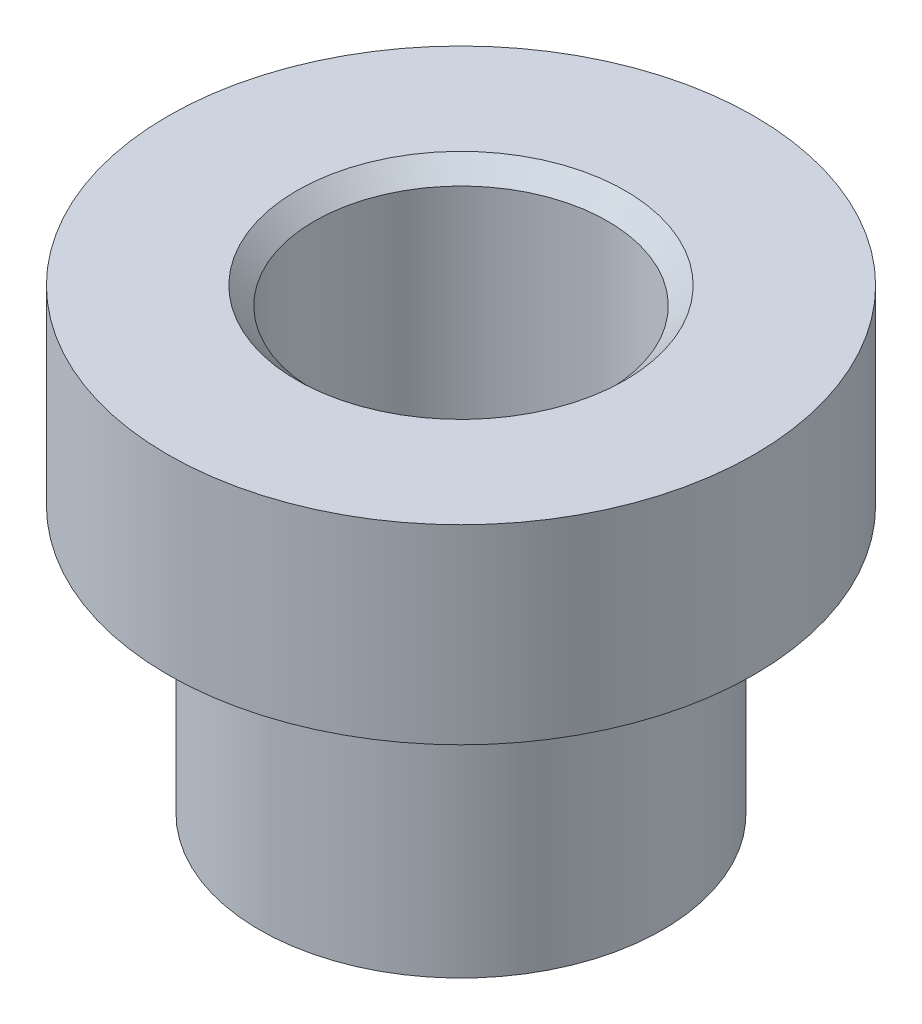
ISO-10303-21;
HEADER;
FILE_DESCRIPTION(('STEP AP214'),'2;1');
FILE_NAME('part.step','',(''),(''),'','','');
FILE_SCHEMA(('AUTOMOTIVE_DESIGN { 1 0 10303 214 1 1 1 1 }'));
ENDSEC;
DATA;
#1=APPLICATION_CONTEXT('core data for automotive mechanical design processes');
#2=APPLICATION_PROTOCOL_DEFINITION('international standard','automotive_design',2000,#1);
#3=PRODUCT_CONTEXT('',#1,'mechanical');
#4=PRODUCT('Part','Part','',(#3));
#5=PRODUCT_RELATED_PRODUCT_CATEGORY('part','',(#4));
#6=PRODUCT_DEFINITION_FORMATION('','',#4);
#7=PRODUCT_DEFINITION_CONTEXT('part definition',#1,'design');
#8=PRODUCT_DEFINITION('design','',#6,#7);
#9=PRODUCT_DEFINITION_SHAPE('','',#8);
#10=(LENGTH_UNIT() NAMED_UNIT(*) SI_UNIT(.MILLI.,.METRE.));
#11=(NAMED_UNIT(*) PLANE_ANGLE_UNIT() SI_UNIT($,.RADIAN.));
#12=(NAMED_UNIT(*) SI_UNIT($,.STERADIAN.) SOLID_ANGLE_UNIT());
#13=UNCERTAINTY_MEASURE_WITH_UNIT(LENGTH_MEASURE(1.E-05),#10,'distance_accuracy_value','');
#14=(GEOMETRIC_REPRESENTATION_CONTEXT(3) GLOBAL_UNCERTAINTY_ASSIGNED_CONTEXT((#13)) GLOBAL_UNIT_ASSIGNED_CONTEXT((#10,
#11,#12)) REPRESENTATION_CONTEXT('',''));
#15=CARTESIAN_POINT('',(0.,0.,0.));
#16=DIRECTION('',(0.,0.,1.));
#17=DIRECTION('',(1.,0.,0.));
#18=AXIS2_PLACEMENT_3D('',#15,#16,#17);
#19=CARTESIAN_POINT('',(0.,-11.049,0.));
#20=DIRECTION('',(0.,1.,0.));
#21=DIRECTION('',(-1.,0.,0.));
#22=AXIS2_PLACEMENT_3D('',#19,#20,#21);
#23=CYLINDRICAL_SURFACE('',#22,8.73125);
#24=CARTESIAN_POINT('',(0.,0.,0.));
#25=DIRECTION('',(0.,1.,0.));
#26=DIRECTION('',(-1.,0.,0.));
#27=AXIS2_PLACEMENT_3D('',#24,#25,#26);
#28=CIRCLE('',#27,8.73125);
#29=CARTESIAN_POINT('',(-8.73125,0.,0.));
#30=VERTEX_POINT('',#29);
#31=EDGE_CURVE('E57',#30,#30,#28,.T.);
#32=ORIENTED_EDGE('',*,*,#31,.F.);
#33=EDGE_LOOP('',(#32));
#34=FACE_BOUND('',#33,.T.);
#35=CARTESIAN_POINT('',(0.,-11.557,0.));
#36=DIRECTION('',(0.,1.,0.));
#37=DIRECTION('',(-1.,0.,0.));
#38=AXIS2_PLACEMENT_3D('',#35,#36,#37);
#39=CIRCLE('',#38,8.73125);
#40=CARTESIAN_POINT('',(-8.73125,-11.557,0.));
#41=VERTEX_POINT('',#40);
#42=EDGE_CURVE('E42',#41,#41,#39,.T.);
#43=ORIENTED_EDGE('',*,*,#42,.T.);
#44=EDGE_LOOP('',(#43));
#45=FACE_BOUND('',#44,.T.);
#46=ADVANCED_FACE('F31',(#34,#45),#23,.T.);
#47=CARTESIAN_POINT('',(0.,-11.557,0.));
#48=DIRECTION('',(0.,1.,0.));
#49=DIRECTION('',(-1.,0.,0.));
#50=AXIS2_PLACEMENT_3D('',#47,#48,#49);
#51=PLANE('',#50);
#52=ORIENTED_EDGE('',*,*,#42,.F.);
#53=EDGE_LOOP('',(#52));
#54=FACE_BOUND('',#53,.T.);
#55=ADVANCED_FACE('F65',(#54),#51,.F.);
#56=CARTESIAN_POINT('',(6.35,-11.049,0.));
#57=DIRECTION('',(0.,-1.,0.));
#58=DIRECTION('',(1.,0.,0.));
#59=AXIS2_PLACEMENT_3D('',#56,#57,#58);
#60=PLANE('',#59);
#61=CARTESIAN_POINT('',(0.,-11.049,0.));
#62=DIRECTION('',(0.,1.,0.));
#63=DIRECTION('',(-1.,0.,0.));
#64=AXIS2_PLACEMENT_3D('',#61,#62,#63);
#65=CIRCLE('',#64,6.35);
#66=CARTESIAN_POINT('',(-6.35,-11.049,0.));
#67=VERTEX_POINT('',#66);
#68=EDGE_CURVE('E46',#67,#67,#65,.T.);
#69=ORIENTED_EDGE('',*,*,#68,.T.);
#70=EDGE_LOOP('',(#69));
#71=FACE_BOUND('',#70,.T.);
#72=ADVANCED_FACE('F69',(#71),#60,.F.);
#73=CARTESIAN_POINT('',(0.,-11.049,0.));
#74=DIRECTION('',(0.,1.,0.));
#75=DIRECTION('',(-1.,0.,0.));
#76=AXIS2_PLACEMENT_3D('',#73,#74,#75);
#77=CYLINDRICAL_SURFACE('',#76,6.35);
#78=CARTESIAN_POINT('',(0.,7.493,0.));
#79=DIRECTION('',(0.,-1.,0.));
#80=DIRECTION('',(1.,0.,0.));
#81=AXIS2_PLACEMENT_3D('',#78,#79,#80);
#82=CIRCLE('',#81,6.35);
#83=CARTESIAN_POINT('',(6.35,7.493,0.));
#84=VERTEX_POINT('',#83);
#85=EDGE_CURVE('E38',#84,#84,#82,.F.);
#86=ORIENTED_EDGE('',*,*,#85,.T.);
#87=EDGE_LOOP('',(#86));
#88=FACE_BOUND('',#87,.T.);
#89=ORIENTED_EDGE('',*,*,#68,.F.);
#90=EDGE_LOOP('',(#89));
#91=FACE_BOUND('',#90,.T.);
#92=ADVANCED_FACE('F74',(#88,#91),#77,.F.);
#93=CARTESIAN_POINT('',(12.7,8.255,0.));
#94=DIRECTION('',(0.,-1.,0.));
#95=DIRECTION('',(1.,0.,0.));
#96=AXIS2_PLACEMENT_3D('',#93,#94,#95);
#97=PLANE('',#96);
#98=CARTESIAN_POINT('',(0.,8.255,0.));
#99=DIRECTION('',(0.,-1.,0.));
#100=DIRECTION('',(1.,0.,0.));
#101=AXIS2_PLACEMENT_3D('',#98,#99,#100);
#102=CIRCLE('',#101,7.11200000000001);
#103=CARTESIAN_POINT('',(7.11200000000001,8.255,0.));
#104=VERTEX_POINT('',#103);
#105=EDGE_CURVE('E10',#104,#104,#102,.T.);
#106=ORIENTED_EDGE('',*,*,#105,.T.);
#107=EDGE_LOOP('',(#106));
#108=FACE_BOUND('',#107,.T.);
#109=CARTESIAN_POINT('',(0.,8.255,0.));
#110=DIRECTION('',(0.,1.,0.));
#111=DIRECTION('',(-1.,0.,0.));
#112=AXIS2_PLACEMENT_3D('',#109,#110,#111);
#113=CIRCLE('',#112,12.7);
#114=CARTESIAN_POINT('',(-12.7,8.255,0.));
#115=VERTEX_POINT('',#114);
#116=EDGE_CURVE('E51',#115,#115,#113,.T.);
#117=ORIENTED_EDGE('',*,*,#116,.T.);
#118=EDGE_LOOP('',(#117));
#119=FACE_BOUND('',#118,.T.);
#120=ADVANCED_FACE('F80',(#108,#119),#97,.F.);
#121=CARTESIAN_POINT('',(0.,-11.049,0.));
#122=DIRECTION('',(0.,1.,0.));
#123=DIRECTION('',(-1.,0.,0.));
#124=AXIS2_PLACEMENT_3D('',#121,#122,#123);
#125=CYLINDRICAL_SURFACE('',#124,12.7);
#126=ORIENTED_EDGE('',*,*,#116,.F.);
#127=EDGE_LOOP('',(#126));
#128=FACE_BOUND('',#127,.T.);
#129=CARTESIAN_POINT('',(0.,0.,0.));
#130=DIRECTION('',(0.,1.,0.));
#131=DIRECTION('',(-1.,0.,0.));
#132=AXIS2_PLACEMENT_3D('',#129,#130,#131);
#133=CIRCLE('',#132,12.7);
#134=CARTESIAN_POINT('',(-12.7,0.,0.));
#135=VERTEX_POINT('',#134);
#136=EDGE_CURVE('E54',#135,#135,#133,.T.);
#137=ORIENTED_EDGE('',*,*,#136,.T.);
#138=EDGE_LOOP('',(#137));
#139=FACE_BOUND('',#138,.T.);
#140=ADVANCED_FACE('F83',(#128,#139),#125,.T.);
#141=CARTESIAN_POINT('',(8.73125,0.,0.));
#142=DIRECTION('',(0.,1.,0.));
#143=DIRECTION('',(-1.,0.,0.));
#144=AXIS2_PLACEMENT_3D('',#141,#142,#143);
#145=PLANE('',#144);
#146=ORIENTED_EDGE('',*,*,#136,.F.);
#147=EDGE_LOOP('',(#146));
#148=FACE_BOUND('',#147,.T.);
#149=ORIENTED_EDGE('',*,*,#31,.T.);
#150=EDGE_LOOP('',(#149));
#151=FACE_BOUND('',#150,.T.);
#152=ADVANCED_FACE('F61',(#148,#151),#145,.F.);
#153=CARTESIAN_POINT('',(0.,7.493,0.));
#154=DIRECTION('',(0.,1.,0.));
#155=DIRECTION('',(-1.,0.,0.));
#156=AXIS2_PLACEMENT_3D('',#153,#154,#155);
#157=CONICAL_SURFACE('',#156,6.35,0.785398163397457);
#158=ORIENTED_EDGE('',*,*,#105,.F.);
#159=EDGE_LOOP('',(#158));
#160=FACE_BOUND('',#159,.T.);
#161=ORIENTED_EDGE('',*,*,#85,.F.);
#162=EDGE_LOOP('',(#161));
#163=FACE_BOUND('',#162,.T.);
#164=ADVANCED_FACE('F33',(#160,#163),#157,.F.);
#165=CLOSED_SHELL('',(#46,#55,#72,#92,#120,#140,#152,#164));
#166=MANIFOLD_SOLID_BREP('B2',#165);
#167=ADVANCED_BREP_SHAPE_REPRESENTATION('',(#18,#166),#14);
#168=SHAPE_DEFINITION_REPRESENTATION(#9,#167);
ENDSEC;
END-ISO-10303-21;
